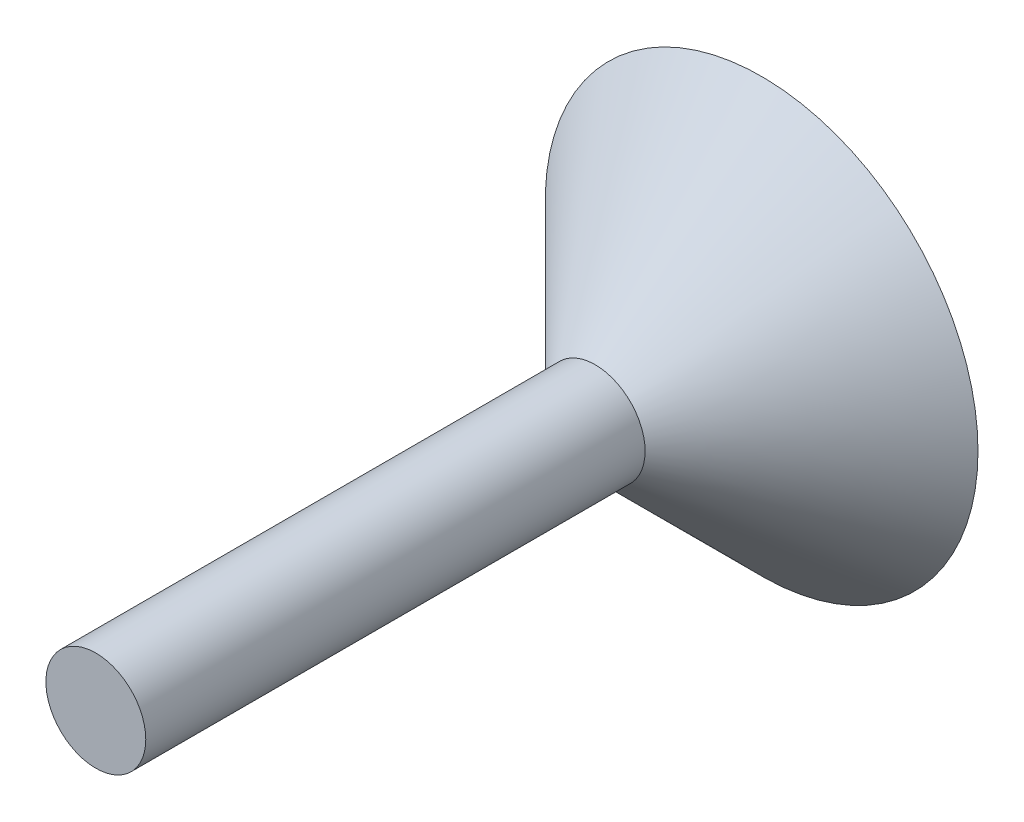
ISO-10303-21;
HEADER;
FILE_DESCRIPTION(('STEP AP214'),'2;1');
FILE_NAME('part.step','',(''),(''),'','','');
FILE_SCHEMA(('AUTOMOTIVE_DESIGN { 1 0 10303 214 1 1 1 1 }'));
ENDSEC;
DATA;
#1=APPLICATION_CONTEXT('core data for automotive mechanical design processes');
#2=APPLICATION_PROTOCOL_DEFINITION('international standard','automotive_design',2000,#1);
#3=PRODUCT_CONTEXT('',#1,'mechanical');
#4=PRODUCT('Part','Part','',(#3));
#5=PRODUCT_RELATED_PRODUCT_CATEGORY('part','',(#4));
#6=PRODUCT_DEFINITION_FORMATION('','',#4);
#7=PRODUCT_DEFINITION_CONTEXT('part definition',#1,'design');
#8=PRODUCT_DEFINITION('design','',#6,#7);
#9=PRODUCT_DEFINITION_SHAPE('','',#8);
#10=(LENGTH_UNIT() NAMED_UNIT(*) SI_UNIT(.MILLI.,.METRE.));
#11=(NAMED_UNIT(*) PLANE_ANGLE_UNIT() SI_UNIT($,.RADIAN.));
#12=(NAMED_UNIT(*) SI_UNIT($,.STERADIAN.) SOLID_ANGLE_UNIT());
#13=UNCERTAINTY_MEASURE_WITH_UNIT(LENGTH_MEASURE(1.E-05),#10,'distance_accuracy_value','');
#14=(GEOMETRIC_REPRESENTATION_CONTEXT(3) GLOBAL_UNCERTAINTY_ASSIGNED_CONTEXT((#13)) GLOBAL_UNIT_ASSIGNED_CONTEXT((#10,
#11,#12)) REPRESENTATION_CONTEXT('',''));
#15=CARTESIAN_POINT('',(0.,0.,0.));
#16=DIRECTION('',(0.,0.,1.));
#17=DIRECTION('',(1.,0.,0.));
#18=AXIS2_PLACEMENT_3D('',#15,#16,#17);
#19=CARTESIAN_POINT('',(0.,0.,0.));
#20=DIRECTION('',(0.,0.,1.));
#21=DIRECTION('',(1.,0.,0.));
#22=AXIS2_PLACEMENT_3D('',#19,#20,#21);
#23=PLANE('',#22);
#24=CARTESIAN_POINT('',(0.,0.,0.));
#25=DIRECTION('',(0.,0.,1.));
#26=DIRECTION('',(1.,0.,0.));
#27=AXIS2_PLACEMENT_3D('',#24,#25,#26);
#28=CIRCLE('',#27,3.);
#29=CARTESIAN_POINT('',(3.,0.,0.));
#30=VERTEX_POINT('',#29);
#31=EDGE_CURVE('E10',#30,#30,#28,.T.);
#32=ORIENTED_EDGE('',*,*,#31,.T.);
#33=EDGE_LOOP('',(#32));
#34=FACE_BOUND('',#33,.T.);
#35=ADVANCED_FACE('F33',(#34),#23,.T.);
#36=CARTESIAN_POINT('',(0.,0.,0.));
#37=DIRECTION('',(0.,0.,1.));
#38=DIRECTION('',(1.,0.,0.));
#39=AXIS2_PLACEMENT_3D('',#36,#37,#38);
#40=CYLINDRICAL_SURFACE('',#39,3.);
#41=CARTESIAN_POINT('',(0.,0.,-29.9999999999998));
#42=DIRECTION('',(0.,0.,1.));
#43=DIRECTION('',(1.,0.,0.));
#44=AXIS2_PLACEMENT_3D('',#41,#42,#43);
#45=CIRCLE('',#44,3.);
#46=CARTESIAN_POINT('',(3.,0.,-29.9999999999998));
#47=VERTEX_POINT('',#46);
#48=EDGE_CURVE('E39',#47,#47,#45,.T.);
#49=ORIENTED_EDGE('',*,*,#48,.T.);
#50=EDGE_LOOP('',(#49));
#51=FACE_BOUND('',#50,.T.);
#52=ORIENTED_EDGE('',*,*,#31,.F.);
#53=EDGE_LOOP('',(#52));
#54=FACE_BOUND('',#53,.T.);
#55=ADVANCED_FACE('F59',(#51,#54),#40,.T.);
#56=CARTESIAN_POINT('',(0.,0.,-29.9999999999998));
#57=DIRECTION('',(0.,0.,-1.));
#58=DIRECTION('',(-1.,0.,0.));
#59=AXIS2_PLACEMENT_3D('',#56,#57,#58);
#60=CONICAL_SURFACE('',#59,3.,0.785398163397436);
#61=CARTESIAN_POINT('',(0.,0.,-40.));
#62=DIRECTION('',(0.,0.,1.));
#63=DIRECTION('',(1.,0.,0.));
#64=AXIS2_PLACEMENT_3D('',#61,#62,#63);
#65=CIRCLE('',#64,13.);
#66=CARTESIAN_POINT('',(13.,0.,-40.));
#67=VERTEX_POINT('',#66);
#68=EDGE_CURVE('E43',#67,#67,#65,.T.);
#69=ORIENTED_EDGE('',*,*,#68,.T.);
#70=EDGE_LOOP('',(#69));
#71=FACE_BOUND('',#70,.T.);
#72=ORIENTED_EDGE('',*,*,#48,.F.);
#73=EDGE_LOOP('',(#72));
#74=FACE_BOUND('',#73,.T.);
#75=ADVANCED_FACE('F50',(#71,#74),#60,.T.);
#76=CARTESIAN_POINT('',(0.,-13.,-40.));
#77=DIRECTION('',(0.,0.,-1.));
#78=DIRECTION('',(-1.,0.,0.));
#79=AXIS2_PLACEMENT_3D('',#76,#77,#78);
#80=PLANE('',#79);
#81=ORIENTED_EDGE('',*,*,#68,.F.);
#82=EDGE_LOOP('',(#81));
#83=FACE_BOUND('',#82,.T.);
#84=ADVANCED_FACE('F53',(#83),#80,.T.);
#85=CLOSED_SHELL('',(#35,#55,#75,#84));
#86=MANIFOLD_SOLID_BREP('B2',#85);
#87=ADVANCED_BREP_SHAPE_REPRESENTATION('',(#18,#86),#14);
#88=SHAPE_DEFINITION_REPRESENTATION(#9,#87);
ENDSEC;
END-ISO-10303-21;
